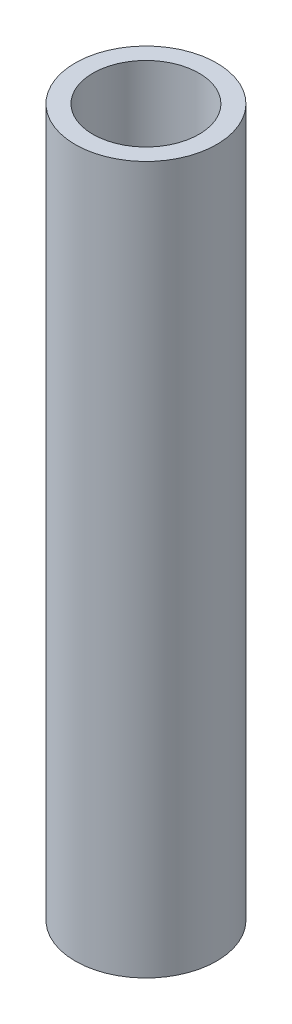
ISO-10303-21;
HEADER;
FILE_DESCRIPTION(('STEP AP214'),'2;1');
FILE_NAME('part.step','',(''),(''),'','','');
FILE_SCHEMA(('AUTOMOTIVE_DESIGN { 1 0 10303 214 1 1 1 1 }'));
ENDSEC;
DATA;
#1=APPLICATION_CONTEXT('core data for automotive mechanical design processes');
#2=APPLICATION_PROTOCOL_DEFINITION('international standard','automotive_design',2000,#1);
#3=PRODUCT_CONTEXT('',#1,'mechanical');
#4=PRODUCT('Part','Part','',(#3));
#5=PRODUCT_RELATED_PRODUCT_CATEGORY('part','',(#4));
#6=PRODUCT_DEFINITION_FORMATION('','',#4);
#7=PRODUCT_DEFINITION_CONTEXT('part definition',#1,'design');
#8=PRODUCT_DEFINITION('design','',#6,#7);
#9=PRODUCT_DEFINITION_SHAPE('','',#8);
#10=(LENGTH_UNIT() NAMED_UNIT(*) SI_UNIT(.MILLI.,.METRE.));
#11=(NAMED_UNIT(*) PLANE_ANGLE_UNIT() SI_UNIT($,.RADIAN.));
#12=(NAMED_UNIT(*) SI_UNIT($,.STERADIAN.) SOLID_ANGLE_UNIT());
#13=UNCERTAINTY_MEASURE_WITH_UNIT(LENGTH_MEASURE(1.E-05),#10,'distance_accuracy_value','');
#14=(GEOMETRIC_REPRESENTATION_CONTEXT(3) GLOBAL_UNCERTAINTY_ASSIGNED_CONTEXT((#13)) GLOBAL_UNIT_ASSIGNED_CONTEXT((#10,
#11,#12)) REPRESENTATION_CONTEXT('',''));
#15=CARTESIAN_POINT('',(0.,0.,0.));
#16=DIRECTION('',(0.,0.,1.));
#17=DIRECTION('',(1.,0.,0.));
#18=AXIS2_PLACEMENT_3D('',#15,#16,#17);
#19=CARTESIAN_POINT('',(0.,100.,0.));
#20=DIRECTION('',(0.,1.,0.));
#21=DIRECTION('',(0.,0.,1.));
#22=AXIS2_PLACEMENT_3D('',#19,#20,#21);
#23=PLANE('',#22);
#24=CARTESIAN_POINT('',(0.,100.,0.));
#25=DIRECTION('',(0.,1.,0.));
#26=DIRECTION('',(0.,0.,1.));
#27=AXIS2_PLACEMENT_3D('',#24,#25,#26);
#28=CIRCLE('',#27,10.);
#29=CARTESIAN_POINT('',(0.,100.,10.));
#30=VERTEX_POINT('',#29);
#31=EDGE_CURVE('E10',#30,#30,#28,.T.);
#32=ORIENTED_EDGE('',*,*,#31,.T.);
#33=EDGE_LOOP('',(#32));
#34=FACE_BOUND('',#33,.T.);
#35=CARTESIAN_POINT('',(0.,100.,0.));
#36=DIRECTION('',(0.,1.,0.));
#37=DIRECTION('',(0.,0.,1.));
#38=AXIS2_PLACEMENT_3D('',#35,#36,#37);
#39=CIRCLE('',#38,7.5);
#40=CARTESIAN_POINT('',(0.,100.,7.5));
#41=VERTEX_POINT('',#40);
#42=EDGE_CURVE('E41',#41,#41,#39,.T.);
#43=ORIENTED_EDGE('',*,*,#42,.F.);
#44=EDGE_LOOP('',(#43));
#45=FACE_BOUND('',#44,.T.);
#46=ADVANCED_FACE('F30',(#34,#45),#23,.T.);
#47=CARTESIAN_POINT('',(0.,0.,0.));
#48=DIRECTION('',(0.,1.,0.));
#49=DIRECTION('',(0.,0.,1.));
#50=AXIS2_PLACEMENT_3D('',#47,#48,#49);
#51=PLANE('',#50);
#52=CARTESIAN_POINT('',(0.,0.,0.));
#53=DIRECTION('',(0.,1.,0.));
#54=DIRECTION('',(0.,0.,1.));
#55=AXIS2_PLACEMENT_3D('',#52,#53,#54);
#56=CIRCLE('',#55,10.);
#57=CARTESIAN_POINT('',(0.,0.,10.));
#58=VERTEX_POINT('',#57);
#59=EDGE_CURVE('E34',#58,#58,#56,.T.);
#60=ORIENTED_EDGE('',*,*,#59,.F.);
#61=EDGE_LOOP('',(#60));
#62=FACE_BOUND('',#61,.T.);
#63=CARTESIAN_POINT('',(0.,0.,0.));
#64=DIRECTION('',(0.,1.,0.));
#65=DIRECTION('',(0.,0.,1.));
#66=AXIS2_PLACEMENT_3D('',#63,#64,#65);
#67=CIRCLE('',#66,7.5);
#68=CARTESIAN_POINT('',(0.,0.,7.5));
#69=VERTEX_POINT('',#68);
#70=EDGE_CURVE('E43',#69,#69,#67,.T.);
#71=ORIENTED_EDGE('',*,*,#70,.T.);
#72=EDGE_LOOP('',(#71));
#73=FACE_BOUND('',#72,.T.);
#74=ADVANCED_FACE('F53',(#62,#73),#51,.F.);
#75=CARTESIAN_POINT('',(0.,100.,0.));
#76=DIRECTION('',(0.,-1.,0.));
#77=DIRECTION('',(0.,0.,-1.));
#78=AXIS2_PLACEMENT_3D('',#75,#76,#77);
#79=CYLINDRICAL_SURFACE('',#78,10.);
#80=ORIENTED_EDGE('',*,*,#31,.F.);
#81=EDGE_LOOP('',(#80));
#82=FACE_BOUND('',#81,.T.);
#83=ORIENTED_EDGE('',*,*,#59,.T.);
#84=EDGE_LOOP('',(#83));
#85=FACE_BOUND('',#84,.T.);
#86=ADVANCED_FACE('F32',(#82,#85),#79,.T.);
#87=CARTESIAN_POINT('',(0.,100.,0.));
#88=DIRECTION('',(0.,-1.,0.));
#89=DIRECTION('',(0.,0.,-1.));
#90=AXIS2_PLACEMENT_3D('',#87,#88,#89);
#91=CYLINDRICAL_SURFACE('',#90,7.5);
#92=ORIENTED_EDGE('',*,*,#42,.T.);
#93=EDGE_LOOP('',(#92));
#94=FACE_BOUND('',#93,.T.);
#95=ORIENTED_EDGE('',*,*,#70,.F.);
#96=EDGE_LOOP('',(#95));
#97=FACE_BOUND('',#96,.T.);
#98=ADVANCED_FACE('F49',(#94,#97),#91,.F.);
#99=CLOSED_SHELL('',(#46,#74,#86,#98));
#100=MANIFOLD_SOLID_BREP('B2',#99);
#101=ADVANCED_BREP_SHAPE_REPRESENTATION('',(#18,#100),#14);
#102=SHAPE_DEFINITION_REPRESENTATION(#9,#101);
ENDSEC;
END-ISO-10303-21;
